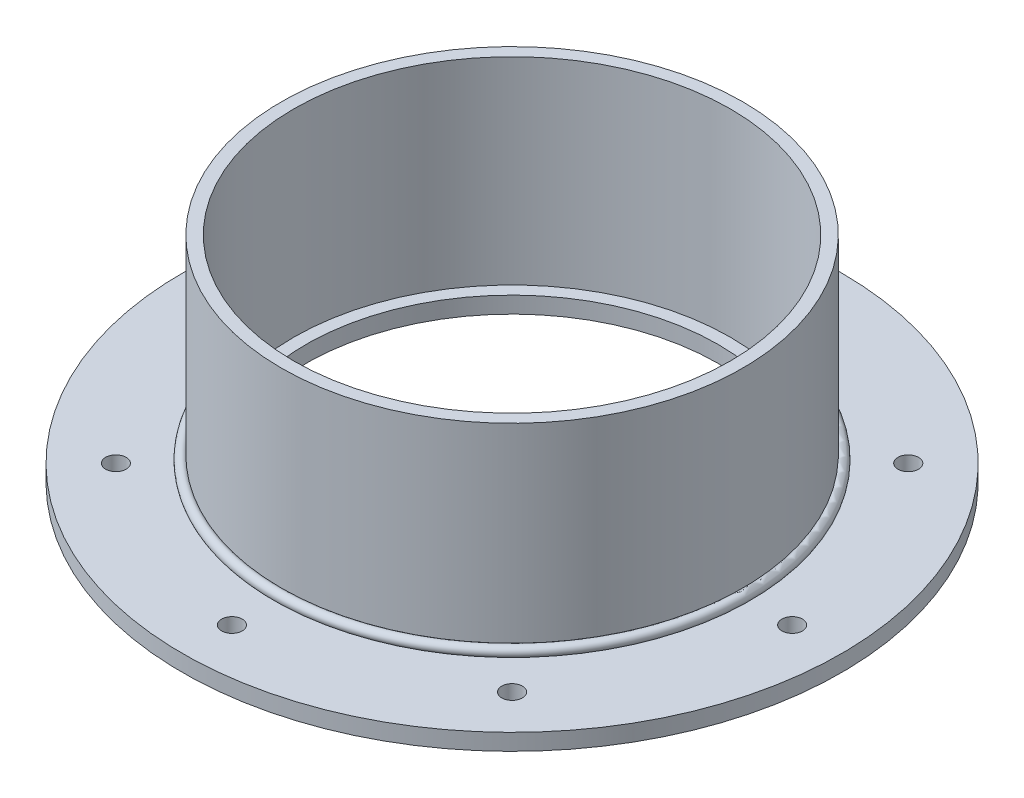
ISO-10303-21;
HEADER;
FILE_DESCRIPTION(('STEP AP214'),'2;1');
FILE_NAME('part.step','',(''),(''),'','','');
FILE_SCHEMA(('AUTOMOTIVE_DESIGN { 1 0 10303 214 1 1 1 1 }'));
ENDSEC;
DATA;
#1=APPLICATION_CONTEXT('core data for automotive mechanical design processes');
#2=APPLICATION_PROTOCOL_DEFINITION('international standard','automotive_design',2000,#1);
#3=PRODUCT_CONTEXT('',#1,'mechanical');
#4=PRODUCT('Part','Part','',(#3));
#5=PRODUCT_RELATED_PRODUCT_CATEGORY('part','',(#4));
#6=PRODUCT_DEFINITION_FORMATION('','',#4);
#7=PRODUCT_DEFINITION_CONTEXT('part definition',#1,'design');
#8=PRODUCT_DEFINITION('design','',#6,#7);
#9=PRODUCT_DEFINITION_SHAPE('','',#8);
#10=(LENGTH_UNIT() NAMED_UNIT(*) SI_UNIT(.MILLI.,.METRE.));
#11=(NAMED_UNIT(*) PLANE_ANGLE_UNIT() SI_UNIT($,.RADIAN.));
#12=(NAMED_UNIT(*) SI_UNIT($,.STERADIAN.) SOLID_ANGLE_UNIT());
#13=UNCERTAINTY_MEASURE_WITH_UNIT(LENGTH_MEASURE(1.E-05),#10,'distance_accuracy_value','');
#14=(GEOMETRIC_REPRESENTATION_CONTEXT(3) GLOBAL_UNCERTAINTY_ASSIGNED_CONTEXT((#13)) GLOBAL_UNIT_ASSIGNED_CONTEXT((#10,
#11,#12)) REPRESENTATION_CONTEXT('',''));
#15=CARTESIAN_POINT('',(0.,0.,0.));
#16=DIRECTION('',(0.,0.,1.));
#17=DIRECTION('',(1.,0.,0.));
#18=AXIS2_PLACEMENT_3D('',#15,#16,#17);
#19=CARTESIAN_POINT('',(0.,7.57337288963903,0.));
#20=DIRECTION('',(0.,-1.,0.));
#21=DIRECTION('',(0.,0.,-1.));
#22=AXIS2_PLACEMENT_3D('',#19,#20,#21);
#23=TOROIDAL_SURFACE('',#22,90.1233728896391,1.98437499999999);
#24=CARTESIAN_POINT('',(0.,6.34999999999999,0.));
#25=DIRECTION('',(0.,-1.,0.));
#26=DIRECTION('',(0.,0.,-1.));
#27=AXIS2_PLACEMENT_3D('',#24,#25,#26);
#28=CIRCLE('',#27,91.6857758189506);
#29=CARTESIAN_POINT('',(0.,6.34999999999999,-91.6857758189506));
#30=VERTEX_POINT('',#29);
#31=EDGE_CURVE('E11',#30,#30,#28,.T.);
#32=ORIENTED_EDGE('',*,*,#31,.F.);
#33=EDGE_LOOP('',(#32));
#34=FACE_BOUND('',#33,.T.);
#35=CARTESIAN_POINT('',(0.,9.13577581895054,0.));
#36=DIRECTION('',(0.,-1.,0.));
#37=DIRECTION('',(0.,0.,-1.));
#38=AXIS2_PLACEMENT_3D('',#35,#36,#37);
#39=CIRCLE('',#38,88.9);
#40=CARTESIAN_POINT('',(0.,9.13577581895054,-88.9));
#41=VERTEX_POINT('',#40);
#42=EDGE_CURVE('E61',#41,#41,#39,.T.);
#43=ORIENTED_EDGE('',*,*,#42,.T.);
#44=EDGE_LOOP('',(#43));
#45=FACE_BOUND('',#44,.T.);
#46=ADVANCED_FACE('F48',(#34,#45),#23,.T.);
#47=CARTESIAN_POINT('',(-88.9,6.34999999999999,0.));
#48=DIRECTION('',(0.,1.,0.));
#49=DIRECTION('',(0.,0.,1.));
#50=AXIS2_PLACEMENT_3D('',#47,#48,#49);
#51=PLANE('',#50);
#52=CARTESIAN_POINT('',(0.,6.34999999999999,0.));
#53=DIRECTION('',(0.,-1.,0.));
#54=DIRECTION('',(0.,0.,-1.));
#55=AXIS2_PLACEMENT_3D('',#52,#53,#54);
#56=CIRCLE('',#55,88.9);
#57=CARTESIAN_POINT('',(0.,6.34999999999999,-88.9));
#58=VERTEX_POINT('',#57);
#59=EDGE_CURVE('E55',#58,#58,#56,.T.);
#60=ORIENTED_EDGE('',*,*,#59,.F.);
#61=EDGE_LOOP('',(#60));
#62=FACE_BOUND('',#61,.T.);
#63=ORIENTED_EDGE('',*,*,#31,.T.);
#64=EDGE_LOOP('',(#63));
#65=FACE_BOUND('',#64,.T.);
#66=ADVANCED_FACE('F74',(#62,#65),#51,.F.);
#67=CARTESIAN_POINT('',(0.,0.,0.));
#68=DIRECTION('',(0.,-1.,0.));
#69=DIRECTION('',(0.,0.,-1.));
#70=AXIS2_PLACEMENT_3D('',#67,#68,#69);
#71=CYLINDRICAL_SURFACE('',#70,88.9);
#72=ORIENTED_EDGE('',*,*,#42,.F.);
#73=EDGE_LOOP('',(#72));
#74=FACE_BOUND('',#73,.T.);
#75=ORIENTED_EDGE('',*,*,#59,.T.);
#76=EDGE_LOOP('',(#75));
#77=FACE_BOUND('',#76,.T.);
#78=ADVANCED_FACE('F72',(#74,#77),#71,.F.);
#79=CLOSED_SHELL('',(#46,#66,#78));
#80=MANIFOLD_SOLID_BREP('B2',#79);
#81=CARTESIAN_POINT('',(0.,0.,0.));
#82=DIRECTION('',(0.,-1.,0.));
#83=DIRECTION('',(0.,0.,-1.));
#84=AXIS2_PLACEMENT_3D('',#81,#82,#83);
#85=CYLINDRICAL_SURFACE('',#84,88.9);
#86=CARTESIAN_POINT('',(0.,6.34999999999999,0.));
#87=DIRECTION('',(0.,-1.,0.));
#88=DIRECTION('',(0.,0.,-1.));
#89=AXIS2_PLACEMENT_3D('',#86,#87,#88);
#90=CIRCLE('',#89,88.9);
#91=CARTESIAN_POINT('',(0.,6.34999999999999,-88.9));
#92=VERTEX_POINT('',#91);
#93=EDGE_CURVE('E133',#92,#92,#90,.T.);
#94=ORIENTED_EDGE('',*,*,#93,.F.);
#95=EDGE_LOOP('',(#94));
#96=FACE_BOUND('',#95,.T.);
#97=CARTESIAN_POINT('',(0.,82.55,0.));
#98=DIRECTION('',(0.,-1.,0.));
#99=DIRECTION('',(0.,0.,-1.));
#100=AXIS2_PLACEMENT_3D('',#97,#98,#99);
#101=CIRCLE('',#100,88.9);
#102=CARTESIAN_POINT('',(0.,82.55,-88.9));
#103=VERTEX_POINT('',#102);
#104=EDGE_CURVE('E47',#103,#103,#101,.T.);
#105=ORIENTED_EDGE('',*,*,#104,.T.);
#106=EDGE_LOOP('',(#105));
#107=FACE_BOUND('',#106,.T.);
#108=ADVANCED_FACE('F114',(#96,#107),#85,.T.);
#109=CARTESIAN_POINT('',(-88.9,82.55,0.));
#110=DIRECTION('',(0.,-1.,0.));
#111=DIRECTION('',(0.,0.,-1.));
#112=AXIS2_PLACEMENT_3D('',#109,#110,#111);
#113=PLANE('',#112);
#114=ORIENTED_EDGE('',*,*,#104,.F.);
#115=EDGE_LOOP('',(#114));
#116=FACE_BOUND('',#115,.T.);
#117=CARTESIAN_POINT('',(0.,82.55,0.));
#118=DIRECTION('',(0.,-1.,0.));
#119=DIRECTION('',(0.,0.,-1.));
#120=AXIS2_PLACEMENT_3D('',#117,#118,#119);
#121=CIRCLE('',#120,84.1375);
#122=CARTESIAN_POINT('',(0.,82.55,-84.1375));
#123=VERTEX_POINT('',#122);
#124=EDGE_CURVE('E121',#123,#123,#121,.T.);
#125=ORIENTED_EDGE('',*,*,#124,.T.);
#126=EDGE_LOOP('',(#125));
#127=FACE_BOUND('',#126,.T.);
#128=ADVANCED_FACE('F144',(#116,#127),#113,.F.);
#129=CARTESIAN_POINT('',(0.,0.,0.));
#130=DIRECTION('',(0.,-1.,0.));
#131=DIRECTION('',(0.,0.,-1.));
#132=AXIS2_PLACEMENT_3D('',#129,#130,#131);
#133=CYLINDRICAL_SURFACE('',#132,84.1375);
#134=ORIENTED_EDGE('',*,*,#124,.F.);
#135=EDGE_LOOP('',(#134));
#136=FACE_BOUND('',#135,.T.);
#137=CARTESIAN_POINT('',(0.,6.34999999999999,0.));
#138=DIRECTION('',(0.,-1.,0.));
#139=DIRECTION('',(0.,0.,-1.));
#140=AXIS2_PLACEMENT_3D('',#137,#138,#139);
#141=CIRCLE('',#140,84.1375);
#142=CARTESIAN_POINT('',(0.,6.34999999999999,-84.1375));
#143=VERTEX_POINT('',#142);
#144=EDGE_CURVE('E127',#143,#143,#141,.T.);
#145=ORIENTED_EDGE('',*,*,#144,.T.);
#146=EDGE_LOOP('',(#145));
#147=FACE_BOUND('',#146,.T.);
#148=ADVANCED_FACE('F148',(#136,#147),#133,.F.);
#149=CARTESIAN_POINT('',(-88.9,6.34999999999999,0.));
#150=DIRECTION('',(0.,1.,0.));
#151=DIRECTION('',(0.,0.,1.));
#152=AXIS2_PLACEMENT_3D('',#149,#150,#151);
#153=PLANE('',#152);
#154=ORIENTED_EDGE('',*,*,#144,.F.);
#155=EDGE_LOOP('',(#154));
#156=FACE_BOUND('',#155,.T.);
#157=ORIENTED_EDGE('',*,*,#93,.T.);
#158=EDGE_LOOP('',(#157));
#159=FACE_BOUND('',#158,.T.);
#160=ADVANCED_FACE('F141',(#156,#159),#153,.F.);
#161=CLOSED_SHELL('',(#108,#128,#148,#160));
#162=MANIFOLD_SOLID_BREP('B6',#161);
#163=CARTESIAN_POINT('',(0.,0.,0.));
#164=DIRECTION('',(0.,-1.,0.));
#165=DIRECTION('',(0.,0.,-1.));
#166=AXIS2_PLACEMENT_3D('',#163,#164,#165);
#167=CYLINDRICAL_SURFACE('',#166,79.375);
#168=CARTESIAN_POINT('',(0.,6.35,0.));
#169=DIRECTION('',(0.,-1.,0.));
#170=DIRECTION('',(0.,0.,-1.));
#171=AXIS2_PLACEMENT_3D('',#168,#169,#170);
#172=CIRCLE('',#171,79.375);
#173=CARTESIAN_POINT('',(0.,6.35,-79.375));
#174=VERTEX_POINT('',#173);
#175=EDGE_CURVE('E113',#174,#174,#172,.T.);
#176=ORIENTED_EDGE('',*,*,#175,.F.);
#177=EDGE_LOOP('',(#176));
#178=FACE_BOUND('',#177,.T.);
#179=CARTESIAN_POINT('',(0.,0.,0.));
#180=DIRECTION('',(0.,-1.,0.));
#181=DIRECTION('',(0.,0.,-1.));
#182=AXIS2_PLACEMENT_3D('',#179,#180,#181);
#183=CIRCLE('',#182,79.375);
#184=CARTESIAN_POINT('',(0.,0.,-79.375));
#185=VERTEX_POINT('',#184);
#186=EDGE_CURVE('E211',#185,#185,#183,.T.);
#187=ORIENTED_EDGE('',*,*,#186,.T.);
#188=EDGE_LOOP('',(#187));
#189=FACE_BOUND('',#188,.T.);
#190=ADVANCED_FACE('F192',(#178,#189),#167,.F.);
#191=CARTESIAN_POINT('',(-79.375,6.34999999999999,0.));
#192=DIRECTION('',(0.,-1.,0.));
#193=DIRECTION('',(0.,0.,-1.));
#194=AXIS2_PLACEMENT_3D('',#191,#192,#193);
#195=PLANE('',#194);
#196=CARTESIAN_POINT('',(-76.3321770290869,6.34999999999999,-76.3321770290887));
#197=DIRECTION('',(0.,1.,0.));
#198=DIRECTION('',(0.707106781186539,0.,0.707106781186556));
#199=AXIS2_PLACEMENT_3D('',#196,#197,#198);
#200=CIRCLE('',#199,3.96875);
#201=CARTESIAN_POINT('',(-73.5258469912528,6.34999999999999,-73.5258469912546));
#202=VERTEX_POINT('',#201);
#203=EDGE_CURVE('E274',#202,#202,#200,.T.);
#204=ORIENTED_EDGE('',*,*,#203,.F.);
#205=EDGE_LOOP('',(#204));
#206=FACE_BOUND('',#205,.T.);
#207=CARTESIAN_POINT('',(-107.95,6.34999999999999,-1.13071623158435E-12));
#208=DIRECTION('',(0.,1.,0.));
#209=DIRECTION('',(1.,0.,0.));
#210=AXIS2_PLACEMENT_3D('',#207,#208,#209);
#211=CIRCLE('',#210,3.96875);
#212=CARTESIAN_POINT('',(-103.98125,6.34999999999999,-1.08914578189375E-12));
#213=VERTEX_POINT('',#212);
#214=EDGE_CURVE('E266',#213,#213,#211,.T.);
#215=ORIENTED_EDGE('',*,*,#214,.F.);
#216=EDGE_LOOP('',(#215));
#217=FACE_BOUND('',#216,.T.);
#218=CARTESIAN_POINT('',(-76.3321770290885,6.34999999999999,76.3321770290871));
#219=DIRECTION('',(0.,1.,0.));
#220=DIRECTION('',(0.707106781186554,0.,-0.707106781186541));
#221=AXIS2_PLACEMENT_3D('',#218,#219,#220);
#222=CIRCLE('',#221,3.96875);
#223=CARTESIAN_POINT('',(-73.5258469912543,6.34999999999999,73.5258469912531));
#224=VERTEX_POINT('',#223);
#225=EDGE_CURVE('E258',#224,#224,#222,.T.);
#226=ORIENTED_EDGE('',*,*,#225,.F.);
#227=EDGE_LOOP('',(#226));
#228=FACE_BOUND('',#227,.T.);
#229=CARTESIAN_POINT('',(0.,6.34999999999999,107.95));
#230=DIRECTION('',(0.,1.,0.));
#231=DIRECTION('',(0.,0.,-1.));
#232=AXIS2_PLACEMENT_3D('',#229,#230,#231);
#233=CIRCLE('',#232,3.96875);
#234=CARTESIAN_POINT('',(0.,6.34999999999999,103.98125));
#235=VERTEX_POINT('',#234);
#236=EDGE_CURVE('E250',#235,#235,#233,.T.);
#237=ORIENTED_EDGE('',*,*,#236,.F.);
#238=EDGE_LOOP('',(#237));
#239=FACE_BOUND('',#238,.T.);
#240=CARTESIAN_POINT('',(76.3321770290874,6.34999999999999,76.3321770290882));
#241=DIRECTION('',(0.,1.,0.));
#242=DIRECTION('',(-0.707106781186544,0.,-0.707106781186551));
#243=AXIS2_PLACEMENT_3D('',#240,#241,#242);
#244=CIRCLE('',#243,3.96875);
#245=CARTESIAN_POINT('',(73.5258469912533,6.34999999999999,73.5258469912541));
#246=VERTEX_POINT('',#245);
#247=EDGE_CURVE('E242',#246,#246,#244,.T.);
#248=ORIENTED_EDGE('',*,*,#247,.F.);
#249=EDGE_LOOP('',(#248));
#250=FACE_BOUND('',#249,.T.);
#251=CARTESIAN_POINT('',(107.95,6.34999999999999,3.76905410528116E-13));
#252=DIRECTION('',(0.,1.,0.));
#253=DIRECTION('',(-1.,0.,0.));
#254=AXIS2_PLACEMENT_3D('',#251,#252,#253);
#255=CIRCLE('',#254,3.96875);
#256=CARTESIAN_POINT('',(103.98125,6.34999999999999,3.63048593964583E-13));
#257=VERTEX_POINT('',#256);
#258=EDGE_CURVE('E234',#257,#257,#255,.T.);
#259=ORIENTED_EDGE('',*,*,#258,.F.);
#260=EDGE_LOOP('',(#259));
#261=FACE_BOUND('',#260,.T.);
#262=CARTESIAN_POINT('',(76.3321770290879,6.34999999999999,-76.3321770290877));
#263=DIRECTION('',(0.,1.,0.));
#264=DIRECTION('',(-0.707106781186549,0.,0.707106781186546));
#265=AXIS2_PLACEMENT_3D('',#262,#263,#264);
#266=CIRCLE('',#265,3.96875);
#267=CARTESIAN_POINT('',(73.5258469912538,6.34999999999999,-73.5258469912536));
#268=VERTEX_POINT('',#267);
#269=EDGE_CURVE('E226',#268,#268,#266,.T.);
#270=ORIENTED_EDGE('',*,*,#269,.F.);
#271=EDGE_LOOP('',(#270));
#272=FACE_BOUND('',#271,.T.);
#273=CARTESIAN_POINT('',(0.,6.34999999999999,-107.95));
#274=DIRECTION('',(0.,1.,0.));
#275=DIRECTION('',(0.,0.,1.));
#276=AXIS2_PLACEMENT_3D('',#273,#274,#275);
#277=CIRCLE('',#276,3.96875);
#278=CARTESIAN_POINT('',(0.,6.34999999999999,-103.98125));
#279=VERTEX_POINT('',#278);
#280=EDGE_CURVE('E218',#279,#279,#277,.T.);
#281=ORIENTED_EDGE('',*,*,#280,.F.);
#282=EDGE_LOOP('',(#281));
#283=FACE_BOUND('',#282,.T.);
#284=CARTESIAN_POINT('',(0.,6.34999999999999,0.));
#285=DIRECTION('',(0.,-1.,0.));
#286=DIRECTION('',(0.,0.,-1.));
#287=AXIS2_PLACEMENT_3D('',#284,#285,#286);
#288=CIRCLE('',#287,127.);
#289=CARTESIAN_POINT('',(0.,6.34999999999999,-127.));
#290=VERTEX_POINT('',#289);
#291=EDGE_CURVE('E199',#290,#290,#288,.T.);
#292=ORIENTED_EDGE('',*,*,#291,.F.);
#293=EDGE_LOOP('',(#292));
#294=FACE_BOUND('',#293,.T.);
#295=ORIENTED_EDGE('',*,*,#175,.T.);
#296=EDGE_LOOP('',(#295));
#297=FACE_BOUND('',#296,.T.);
#298=ADVANCED_FACE('F293',(#206,#217,#228,#239,#250,#261,#272,#283,#294,#297),#195,.F.);
#299=CARTESIAN_POINT('',(0.,0.,0.));
#300=DIRECTION('',(0.,-1.,0.));
#301=DIRECTION('',(0.,0.,-1.));
#302=AXIS2_PLACEMENT_3D('',#299,#300,#301);
#303=CYLINDRICAL_SURFACE('',#302,127.);
#304=CARTESIAN_POINT('',(0.,0.,0.));
#305=DIRECTION('',(0.,-1.,0.));
#306=DIRECTION('',(0.,0.,-1.));
#307=AXIS2_PLACEMENT_3D('',#304,#305,#306);
#308=CIRCLE('',#307,127.);
#309=CARTESIAN_POINT('',(0.,0.,-127.));
#310=VERTEX_POINT('',#309);
#311=EDGE_CURVE('E205',#310,#310,#308,.T.);
#312=ORIENTED_EDGE('',*,*,#311,.F.);
#313=EDGE_LOOP('',(#312));
#314=FACE_BOUND('',#313,.T.);
#315=ORIENTED_EDGE('',*,*,#291,.T.);
#316=EDGE_LOOP('',(#315));
#317=FACE_BOUND('',#316,.T.);
#318=ADVANCED_FACE('F296',(#314,#317),#303,.T.);
#319=CARTESIAN_POINT('',(-79.375,0.,0.));
#320=DIRECTION('',(0.,1.,0.));
#321=DIRECTION('',(0.,0.,1.));
#322=AXIS2_PLACEMENT_3D('',#319,#320,#321);
#323=PLANE('',#322);
#324=CARTESIAN_POINT('',(-76.3321770290869,0.,-76.3321770290887));
#325=DIRECTION('',(0.,1.,0.));
#326=DIRECTION('',(0.707106781186539,0.,0.707106781186556));
#327=AXIS2_PLACEMENT_3D('',#324,#325,#326);
#328=CIRCLE('',#327,3.96875);
#329=CARTESIAN_POINT('',(-73.5258469912528,0.,-73.5258469912546));
#330=VERTEX_POINT('',#329);
#331=EDGE_CURVE('E270',#330,#330,#328,.T.);
#332=ORIENTED_EDGE('',*,*,#331,.T.);
#333=EDGE_LOOP('',(#332));
#334=FACE_BOUND('',#333,.T.);
#335=CARTESIAN_POINT('',(-107.95,0.,-1.13071623158435E-12));
#336=DIRECTION('',(0.,1.,0.));
#337=DIRECTION('',(1.,0.,0.));
#338=AXIS2_PLACEMENT_3D('',#335,#336,#337);
#339=CIRCLE('',#338,3.96875);
#340=CARTESIAN_POINT('',(-103.98125,0.,-1.08914578189375E-12));
#341=VERTEX_POINT('',#340);
#342=EDGE_CURVE('E262',#341,#341,#339,.T.);
#343=ORIENTED_EDGE('',*,*,#342,.T.);
#344=EDGE_LOOP('',(#343));
#345=FACE_BOUND('',#344,.T.);
#346=CARTESIAN_POINT('',(-76.3321770290885,0.,76.3321770290871));
#347=DIRECTION('',(0.,1.,0.));
#348=DIRECTION('',(0.707106781186554,0.,-0.707106781186541));
#349=AXIS2_PLACEMENT_3D('',#346,#347,#348);
#350=CIRCLE('',#349,3.96875);
#351=CARTESIAN_POINT('',(-73.5258469912543,0.,73.5258469912531));
#352=VERTEX_POINT('',#351);
#353=EDGE_CURVE('E254',#352,#352,#350,.T.);
#354=ORIENTED_EDGE('',*,*,#353,.T.);
#355=EDGE_LOOP('',(#354));
#356=FACE_BOUND('',#355,.T.);
#357=CARTESIAN_POINT('',(0.,0.,107.95));
#358=DIRECTION('',(0.,1.,0.));
#359=DIRECTION('',(0.,0.,-1.));
#360=AXIS2_PLACEMENT_3D('',#357,#358,#359);
#361=CIRCLE('',#360,3.96875);
#362=CARTESIAN_POINT('',(0.,0.,103.98125));
#363=VERTEX_POINT('',#362);
#364=EDGE_CURVE('E246',#363,#363,#361,.T.);
#365=ORIENTED_EDGE('',*,*,#364,.T.);
#366=EDGE_LOOP('',(#365));
#367=FACE_BOUND('',#366,.T.);
#368=CARTESIAN_POINT('',(76.3321770290874,0.,76.3321770290882));
#369=DIRECTION('',(0.,1.,0.));
#370=DIRECTION('',(-0.707106781186544,0.,-0.707106781186551));
#371=AXIS2_PLACEMENT_3D('',#368,#369,#370);
#372=CIRCLE('',#371,3.96875);
#373=CARTESIAN_POINT('',(73.5258469912533,0.,73.5258469912541));
#374=VERTEX_POINT('',#373);
#375=EDGE_CURVE('E238',#374,#374,#372,.T.);
#376=ORIENTED_EDGE('',*,*,#375,.T.);
#377=EDGE_LOOP('',(#376));
#378=FACE_BOUND('',#377,.T.);
#379=CARTESIAN_POINT('',(107.95,0.,3.76905410528116E-13));
#380=DIRECTION('',(0.,1.,0.));
#381=DIRECTION('',(-1.,0.,0.));
#382=AXIS2_PLACEMENT_3D('',#379,#380,#381);
#383=CIRCLE('',#382,3.96875);
#384=CARTESIAN_POINT('',(103.98125,0.,3.63048593964583E-13));
#385=VERTEX_POINT('',#384);
#386=EDGE_CURVE('E230',#385,#385,#383,.T.);
#387=ORIENTED_EDGE('',*,*,#386,.T.);
#388=EDGE_LOOP('',(#387));
#389=FACE_BOUND('',#388,.T.);
#390=CARTESIAN_POINT('',(76.3321770290879,0.,-76.3321770290877));
#391=DIRECTION('',(0.,1.,0.));
#392=DIRECTION('',(-0.707106781186549,0.,0.707106781186546));
#393=AXIS2_PLACEMENT_3D('',#390,#391,#392);
#394=CIRCLE('',#393,3.96875);
#395=CARTESIAN_POINT('',(73.5258469912538,0.,-73.5258469912536));
#396=VERTEX_POINT('',#395);
#397=EDGE_CURVE('E222',#396,#396,#394,.T.);
#398=ORIENTED_EDGE('',*,*,#397,.T.);
#399=EDGE_LOOP('',(#398));
#400=FACE_BOUND('',#399,.T.);
#401=CARTESIAN_POINT('',(0.,0.,-107.95));
#402=DIRECTION('',(0.,1.,0.));
#403=DIRECTION('',(0.,0.,1.));
#404=AXIS2_PLACEMENT_3D('',#401,#402,#403);
#405=CIRCLE('',#404,3.96875);
#406=CARTESIAN_POINT('',(0.,0.,-103.98125));
#407=VERTEX_POINT('',#406);
#408=EDGE_CURVE('E217',#407,#407,#405,.T.);
#409=ORIENTED_EDGE('',*,*,#408,.T.);
#410=EDGE_LOOP('',(#409));
#411=FACE_BOUND('',#410,.T.);
#412=ORIENTED_EDGE('',*,*,#186,.F.);
#413=EDGE_LOOP('',(#412));
#414=FACE_BOUND('',#413,.T.);
#415=ORIENTED_EDGE('',*,*,#311,.T.);
#416=EDGE_LOOP('',(#415));
#417=FACE_BOUND('',#416,.T.);
#418=ADVANCED_FACE('F283',(#334,#345,#356,#367,#378,#389,#400,#411,#414,#417),#323,.F.);
#419=CARTESIAN_POINT('',(0.,0.,-107.95));
#420=DIRECTION('',(0.,1.,0.));
#421=DIRECTION('',(0.,0.,1.));
#422=AXIS2_PLACEMENT_3D('',#419,#420,#421);
#423=CYLINDRICAL_SURFACE('',#422,3.96875);
#424=ORIENTED_EDGE('',*,*,#408,.F.);
#425=EDGE_LOOP('',(#424));
#426=FACE_BOUND('',#425,.T.);
#427=ORIENTED_EDGE('',*,*,#280,.T.);
#428=EDGE_LOOP('',(#427));
#429=FACE_BOUND('',#428,.T.);
#430=ADVANCED_FACE('F312',(#426,#429),#423,.F.);
#431=CARTESIAN_POINT('',(76.3321770290879,0.,-76.3321770290877));
#432=DIRECTION('',(0.,1.,0.));
#433=DIRECTION('',(0.,0.,1.));
#434=AXIS2_PLACEMENT_3D('',#431,#432,#433);
#435=CYLINDRICAL_SURFACE('',#434,3.96875);
#436=ORIENTED_EDGE('',*,*,#397,.F.);
#437=EDGE_LOOP('',(#436));
#438=FACE_BOUND('',#437,.T.);
#439=ORIENTED_EDGE('',*,*,#269,.T.);
#440=EDGE_LOOP('',(#439));
#441=FACE_BOUND('',#440,.T.);
#442=ADVANCED_FACE('F314',(#438,#441),#435,.F.);
#443=CARTESIAN_POINT('',(107.95,0.,3.76905410528116E-13));
#444=DIRECTION('',(0.,1.,0.));
#445=DIRECTION('',(0.,0.,1.));
#446=AXIS2_PLACEMENT_3D('',#443,#444,#445);
#447=CYLINDRICAL_SURFACE('',#446,3.96875);
#448=ORIENTED_EDGE('',*,*,#386,.F.);
#449=EDGE_LOOP('',(#448));
#450=FACE_BOUND('',#449,.T.);
#451=ORIENTED_EDGE('',*,*,#258,.T.);
#452=EDGE_LOOP('',(#451));
#453=FACE_BOUND('',#452,.T.);
#454=ADVANCED_FACE('F321',(#450,#453),#447,.F.);
#455=CARTESIAN_POINT('',(76.3321770290874,0.,76.3321770290882));
#456=DIRECTION('',(0.,1.,0.));
#457=DIRECTION('',(0.,0.,1.));
#458=AXIS2_PLACEMENT_3D('',#455,#456,#457);
#459=CYLINDRICAL_SURFACE('',#458,3.96875);
#460=ORIENTED_EDGE('',*,*,#375,.F.);
#461=EDGE_LOOP('',(#460));
#462=FACE_BOUND('',#461,.T.);
#463=ORIENTED_EDGE('',*,*,#247,.T.);
#464=EDGE_LOOP('',(#463));
#465=FACE_BOUND('',#464,.T.);
#466=ADVANCED_FACE('F366',(#462,#465),#459,.F.);
#467=CARTESIAN_POINT('',(0.,0.,107.95));
#468=DIRECTION('',(0.,1.,0.));
#469=DIRECTION('',(0.,0.,1.));
#470=AXIS2_PLACEMENT_3D('',#467,#468,#469);
#471=CYLINDRICAL_SURFACE('',#470,3.96875);
#472=ORIENTED_EDGE('',*,*,#364,.F.);
#473=EDGE_LOOP('',(#472));
#474=FACE_BOUND('',#473,.T.);
#475=ORIENTED_EDGE('',*,*,#236,.T.);
#476=EDGE_LOOP('',(#475));
#477=FACE_BOUND('',#476,.T.);
#478=ADVANCED_FACE('F376',(#474,#477),#471,.F.);
#479=CARTESIAN_POINT('',(-76.3321770290885,0.,76.3321770290871));
#480=DIRECTION('',(0.,1.,0.));
#481=DIRECTION('',(0.,0.,1.));
#482=AXIS2_PLACEMENT_3D('',#479,#480,#481);
#483=CYLINDRICAL_SURFACE('',#482,3.96875);
#484=ORIENTED_EDGE('',*,*,#353,.F.);
#485=EDGE_LOOP('',(#484));
#486=FACE_BOUND('',#485,.T.);
#487=ORIENTED_EDGE('',*,*,#225,.T.);
#488=EDGE_LOOP('',(#487));
#489=FACE_BOUND('',#488,.T.);
#490=ADVANCED_FACE('F386',(#486,#489),#483,.F.);
#491=CARTESIAN_POINT('',(-107.95,0.,-1.13071623158435E-12));
#492=DIRECTION('',(0.,1.,0.));
#493=DIRECTION('',(0.,0.,1.));
#494=AXIS2_PLACEMENT_3D('',#491,#492,#493);
#495=CYLINDRICAL_SURFACE('',#494,3.96875);
#496=ORIENTED_EDGE('',*,*,#342,.F.);
#497=EDGE_LOOP('',(#496));
#498=FACE_BOUND('',#497,.T.);
#499=ORIENTED_EDGE('',*,*,#214,.T.);
#500=EDGE_LOOP('',(#499));
#501=FACE_BOUND('',#500,.T.);
#502=ADVANCED_FACE('F289',(#498,#501),#495,.F.);
#503=CARTESIAN_POINT('',(-76.3321770290869,0.,-76.3321770290887));
#504=DIRECTION('',(0.,1.,0.));
#505=DIRECTION('',(0.,0.,1.));
#506=AXIS2_PLACEMENT_3D('',#503,#504,#505);
#507=CYLINDRICAL_SURFACE('',#506,3.96875);
#508=ORIENTED_EDGE('',*,*,#331,.F.);
#509=EDGE_LOOP('',(#508));
#510=FACE_BOUND('',#509,.T.);
#511=ORIENTED_EDGE('',*,*,#203,.T.);
#512=EDGE_LOOP('',(#511));
#513=FACE_BOUND('',#512,.T.);
#514=ADVANCED_FACE('F286',(#510,#513),#507,.F.);
#515=CLOSED_SHELL('',(#190,#298,#318,#418,#430,#442,#454,#466,#478,#490,#502,#514));
#516=MANIFOLD_SOLID_BREP('B42',#515);
#517=ADVANCED_BREP_SHAPE_REPRESENTATION('',(#18,#80,#162,#516),#14);
#518=SHAPE_DEFINITION_REPRESENTATION(#9,#517);
ENDSEC;
END-ISO-10303-21;
